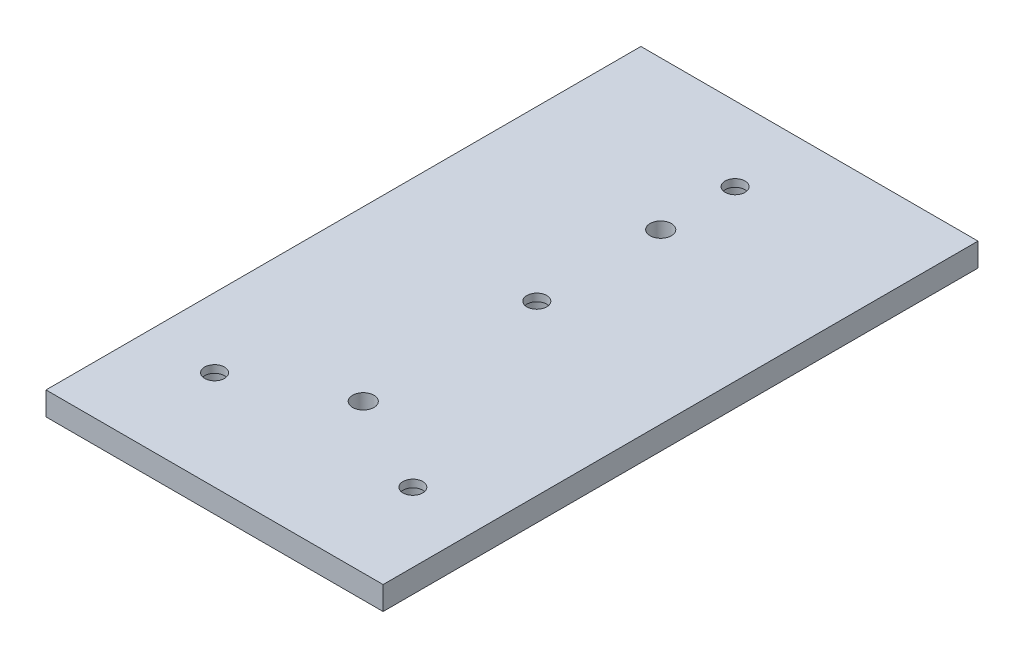
ISO-10303-21;
HEADER;
FILE_DESCRIPTION(('STEP AP214'),'2;1');
FILE_NAME('part.step','',(''),(''),'','','');
FILE_SCHEMA(('AUTOMOTIVE_DESIGN { 1 0 10303 214 1 1 1 1 }'));
ENDSEC;
DATA;
#1=APPLICATION_CONTEXT('core data for automotive mechanical design processes');
#2=APPLICATION_PROTOCOL_DEFINITION('international standard','automotive_design',2000,#1);
#3=PRODUCT_CONTEXT('',#1,'mechanical');
#4=PRODUCT('Part','Part','',(#3));
#5=PRODUCT_RELATED_PRODUCT_CATEGORY('part','',(#4));
#6=PRODUCT_DEFINITION_FORMATION('','',#4);
#7=PRODUCT_DEFINITION_CONTEXT('part definition',#1,'design');
#8=PRODUCT_DEFINITION('design','',#6,#7);
#9=PRODUCT_DEFINITION_SHAPE('','',#8);
#10=(LENGTH_UNIT() NAMED_UNIT(*) SI_UNIT(.MILLI.,.METRE.));
#11=(NAMED_UNIT(*) PLANE_ANGLE_UNIT() SI_UNIT($,.RADIAN.));
#12=(NAMED_UNIT(*) SI_UNIT($,.STERADIAN.) SOLID_ANGLE_UNIT());
#13=UNCERTAINTY_MEASURE_WITH_UNIT(LENGTH_MEASURE(1.E-05),#10,'distance_accuracy_value','');
#14=(GEOMETRIC_REPRESENTATION_CONTEXT(3) GLOBAL_UNCERTAINTY_ASSIGNED_CONTEXT((#13)) GLOBAL_UNIT_ASSIGNED_CONTEXT((#10,
#11,#12)) REPRESENTATION_CONTEXT('',''));
#15=CARTESIAN_POINT('',(0.,0.,0.));
#16=DIRECTION('',(0.,0.,1.));
#17=DIRECTION('',(1.,0.,0.));
#18=AXIS2_PLACEMENT_3D('',#15,#16,#17);
#19=CARTESIAN_POINT('',(45.72,0.,-133.35));
#20=DIRECTION('',(0.,1.,0.));
#21=DIRECTION('',(0.,0.,1.));
#22=AXIS2_PLACEMENT_3D('',#19,#20,#21);
#23=CYLINDRICAL_SURFACE('',#22,2.54000000000002);
#24=CARTESIAN_POINT('',(45.72,5.9944,-133.35));
#25=DIRECTION('',(0.,-1.,0.));
#26=DIRECTION('',(0.,0.,-1.));
#27=AXIS2_PLACEMENT_3D('',#24,#25,#26);
#28=CIRCLE('',#27,2.54000000000002);
#29=CARTESIAN_POINT('',(45.72,5.9944,-135.89));
#30=VERTEX_POINT('',#29);
#31=EDGE_CURVE('E114',#30,#30,#28,.T.);
#32=ORIENTED_EDGE('',*,*,#31,.F.);
#33=EDGE_LOOP('',(#32));
#34=FACE_BOUND('',#33,.T.);
#35=CARTESIAN_POINT('',(45.72,4.064,-133.35));
#36=DIRECTION('',(0.,-1.,0.));
#37=DIRECTION('',(0.,0.,-1.));
#38=AXIS2_PLACEMENT_3D('',#35,#36,#37);
#39=CIRCLE('',#38,2.54000000000002);
#40=CARTESIAN_POINT('',(45.72,4.064,-135.89));
#41=VERTEX_POINT('',#40);
#42=EDGE_CURVE('E41',#41,#41,#39,.F.);
#43=ORIENTED_EDGE('',*,*,#42,.F.);
#44=EDGE_LOOP('',(#43));
#45=FACE_BOUND('',#44,.T.);
#46=ADVANCED_FACE('F37',(#34,#45),#23,.F.);
#47=CARTESIAN_POINT('',(45.72,0.,-82.55));
#48=DIRECTION('',(0.,1.,0.));
#49=DIRECTION('',(0.,0.,1.));
#50=AXIS2_PLACEMENT_3D('',#47,#48,#49);
#51=CYLINDRICAL_SURFACE('',#50,2.54);
#52=CARTESIAN_POINT('',(45.72,5.9944,-82.55));
#53=DIRECTION('',(0.,-1.,0.));
#54=DIRECTION('',(0.,0.,-1.));
#55=AXIS2_PLACEMENT_3D('',#52,#53,#54);
#56=CIRCLE('',#55,2.54);
#57=CARTESIAN_POINT('',(45.72,5.9944,-85.09));
#58=VERTEX_POINT('',#57);
#59=EDGE_CURVE('E118',#58,#58,#56,.T.);
#60=ORIENTED_EDGE('',*,*,#59,.F.);
#61=EDGE_LOOP('',(#60));
#62=FACE_BOUND('',#61,.T.);
#63=CARTESIAN_POINT('',(45.72,4.064,-82.55));
#64=DIRECTION('',(0.,-1.,0.));
#65=DIRECTION('',(0.,0.,-1.));
#66=AXIS2_PLACEMENT_3D('',#63,#64,#65);
#67=CIRCLE('',#66,2.54);
#68=CARTESIAN_POINT('',(45.72,4.064,-85.09));
#69=VERTEX_POINT('',#68);
#70=EDGE_CURVE('E109',#69,#69,#67,.F.);
#71=ORIENTED_EDGE('',*,*,#70,.F.);
#72=EDGE_LOOP('',(#71));
#73=FACE_BOUND('',#72,.T.);
#74=ADVANCED_FACE('F169',(#62,#73),#51,.F.);
#75=CARTESIAN_POINT('',(71.12,0.,-25.4));
#76=DIRECTION('',(0.,1.,0.));
#77=DIRECTION('',(0.,0.,1.));
#78=AXIS2_PLACEMENT_3D('',#75,#76,#77);
#79=CYLINDRICAL_SURFACE('',#78,2.54);
#80=CARTESIAN_POINT('',(71.12,5.9944,-25.4));
#81=DIRECTION('',(0.,-1.,0.));
#82=DIRECTION('',(0.,0.,-1.));
#83=AXIS2_PLACEMENT_3D('',#80,#81,#82);
#84=CIRCLE('',#83,2.54);
#85=CARTESIAN_POINT('',(71.12,5.9944,-27.94));
#86=VERTEX_POINT('',#85);
#87=EDGE_CURVE('E123',#86,#86,#84,.T.);
#88=ORIENTED_EDGE('',*,*,#87,.F.);
#89=EDGE_LOOP('',(#88));
#90=FACE_BOUND('',#89,.T.);
#91=CARTESIAN_POINT('',(71.12,4.064,-25.4));
#92=DIRECTION('',(0.,-1.,0.));
#93=DIRECTION('',(0.,0.,-1.));
#94=AXIS2_PLACEMENT_3D('',#91,#92,#93);
#95=CIRCLE('',#94,2.54);
#96=CARTESIAN_POINT('',(71.12,4.064,-27.94));
#97=VERTEX_POINT('',#96);
#98=EDGE_CURVE('E106',#97,#97,#95,.F.);
#99=ORIENTED_EDGE('',*,*,#98,.F.);
#100=EDGE_LOOP('',(#99));
#101=FACE_BOUND('',#100,.T.);
#102=ADVANCED_FACE('F175',(#90,#101),#79,.F.);
#103=CARTESIAN_POINT('',(20.32,0.,-25.4));
#104=DIRECTION('',(0.,1.,0.));
#105=DIRECTION('',(0.,0.,1.));
#106=AXIS2_PLACEMENT_3D('',#103,#104,#105);
#107=CYLINDRICAL_SURFACE('',#106,2.54);
#108=CARTESIAN_POINT('',(20.32,5.9944,-25.4));
#109=DIRECTION('',(0.,-1.,0.));
#110=DIRECTION('',(0.,0.,-1.));
#111=AXIS2_PLACEMENT_3D('',#108,#109,#110);
#112=CIRCLE('',#111,2.54);
#113=CARTESIAN_POINT('',(20.32,5.9944,-27.94));
#114=VERTEX_POINT('',#113);
#115=EDGE_CURVE('E131',#114,#114,#112,.T.);
#116=ORIENTED_EDGE('',*,*,#115,.F.);
#117=EDGE_LOOP('',(#116));
#118=FACE_BOUND('',#117,.T.);
#119=CARTESIAN_POINT('',(20.32,4.064,-25.4));
#120=DIRECTION('',(0.,-1.,0.));
#121=DIRECTION('',(0.,0.,-1.));
#122=AXIS2_PLACEMENT_3D('',#119,#120,#121);
#123=CIRCLE('',#122,2.54);
#124=CARTESIAN_POINT('',(20.32,4.064,-27.94));
#125=VERTEX_POINT('',#124);
#126=EDGE_CURVE('E103',#125,#125,#123,.F.);
#127=ORIENTED_EDGE('',*,*,#126,.F.);
#128=EDGE_LOOP('',(#127));
#129=FACE_BOUND('',#128,.T.);
#130=ADVANCED_FACE('F324',(#118,#129),#107,.F.);
#131=CARTESIAN_POINT('',(0.,5.9944,0.));
#132=DIRECTION('',(0.,0.,-1.));
#133=DIRECTION('',(-1.,0.,0.));
#134=AXIS2_PLACEMENT_3D('',#131,#132,#133);
#135=PLANE('',#134);
#136=DIRECTION('',(1.,0.,0.));
#137=VECTOR('',#136,1.);
#138=CARTESIAN_POINT('',(0.,5.9944,0.));
#139=LINE('',#138,#137);
#140=CARTESIAN_POINT('',(2.54000000000002,5.9944,0.));
#141=VERTEX_POINT('',#140);
#142=CARTESIAN_POINT('',(88.9,5.9944,0.));
#143=VERTEX_POINT('',#142);
#144=EDGE_CURVE('E63',#141,#143,#139,.T.);
#145=ORIENTED_EDGE('',*,*,#144,.F.);
#146=DIRECTION('',(0.,1.,0.));
#147=VECTOR('',#146,1.);
#148=CARTESIAN_POINT('',(2.54000000000002,0.,0.));
#149=LINE('',#148,#147);
#150=CARTESIAN_POINT('',(2.54000000000002,0.,0.));
#151=VERTEX_POINT('',#150);
#152=EDGE_CURVE('E81',#151,#141,#149,.T.);
#153=ORIENTED_EDGE('',*,*,#152,.F.);
#154=DIRECTION('',(1.,0.,0.));
#155=VECTOR('',#154,1.);
#156=CARTESIAN_POINT('',(0.,0.,0.));
#157=LINE('',#156,#155);
#158=CARTESIAN_POINT('',(88.9,0.,0.));
#159=VERTEX_POINT('',#158);
#160=EDGE_CURVE('E77',#151,#159,#157,.T.);
#161=ORIENTED_EDGE('',*,*,#160,.T.);
#162=DIRECTION('',(0.,-1.,0.));
#163=VECTOR('',#162,1.);
#164=CARTESIAN_POINT('',(88.9,5.9944,0.));
#165=LINE('',#164,#163);
#166=EDGE_CURVE('E11',#143,#159,#165,.T.);
#167=ORIENTED_EDGE('',*,*,#166,.F.);
#168=EDGE_LOOP('',(#145,#153,#161,#167));
#169=FACE_BOUND('',#168,.T.);
#170=ADVANCED_FACE('F78',(#169),#135,.F.);
#171=CARTESIAN_POINT('',(88.9,5.9944,-152.4));
#172=DIRECTION('',(1.,0.,0.));
#173=DIRECTION('',(0.,0.,-1.));
#174=AXIS2_PLACEMENT_3D('',#171,#172,#173);
#175=PLANE('',#174);
#176=DIRECTION('',(0.,0.,1.));
#177=VECTOR('',#176,1.);
#178=CARTESIAN_POINT('',(88.9,0.,-152.4));
#179=LINE('',#178,#177);
#180=CARTESIAN_POINT('',(88.9,0.,-152.4));
#181=VERTEX_POINT('',#180);
#182=EDGE_CURVE('E85',#181,#159,#179,.T.);
#183=ORIENTED_EDGE('',*,*,#182,.F.);
#184=DIRECTION('',(0.,-1.,0.));
#185=VECTOR('',#184,1.);
#186=CARTESIAN_POINT('',(88.9,5.9944,-152.4));
#187=LINE('',#186,#185);
#188=CARTESIAN_POINT('',(88.9,5.9944,-152.4));
#189=VERTEX_POINT('',#188);
#190=EDGE_CURVE('E46',#189,#181,#187,.T.);
#191=ORIENTED_EDGE('',*,*,#190,.F.);
#192=DIRECTION('',(0.,0.,1.));
#193=VECTOR('',#192,1.);
#194=CARTESIAN_POINT('',(88.9,5.9944,-152.4));
#195=LINE('',#194,#193);
#196=EDGE_CURVE('E91',#189,#143,#195,.T.);
#197=ORIENTED_EDGE('',*,*,#196,.T.);
#198=ORIENTED_EDGE('',*,*,#166,.T.);
#199=EDGE_LOOP('',(#183,#191,#197,#198));
#200=FACE_BOUND('',#199,.T.);
#201=ADVANCED_FACE('F89',(#200),#175,.T.);
#202=CARTESIAN_POINT('',(0.,5.9944,-152.4));
#203=DIRECTION('',(0.,0.,-1.));
#204=DIRECTION('',(-1.,0.,0.));
#205=AXIS2_PLACEMENT_3D('',#202,#203,#204);
#206=PLANE('',#205);
#207=DIRECTION('',(0.,1.,0.));
#208=VECTOR('',#207,1.);
#209=CARTESIAN_POINT('',(2.54,0.,-152.4));
#210=LINE('',#209,#208);
#211=CARTESIAN_POINT('',(2.54000000000001,0.,-152.4));
#212=VERTEX_POINT('',#211);
#213=CARTESIAN_POINT('',(2.54,5.9944,-152.4));
#214=VERTEX_POINT('',#213);
#215=EDGE_CURVE('E54',#212,#214,#210,.T.);
#216=ORIENTED_EDGE('',*,*,#215,.T.);
#217=DIRECTION('',(1.,0.,0.));
#218=VECTOR('',#217,1.);
#219=CARTESIAN_POINT('',(0.,5.9944,-152.4));
#220=LINE('',#219,#218);
#221=EDGE_CURVE('E84',#214,#189,#220,.T.);
#222=ORIENTED_EDGE('',*,*,#221,.T.);
#223=ORIENTED_EDGE('',*,*,#190,.T.);
#224=DIRECTION('',(1.,0.,0.));
#225=VECTOR('',#224,1.);
#226=CARTESIAN_POINT('',(0.,0.,-152.4));
#227=LINE('',#226,#225);
#228=EDGE_CURVE('E95',#212,#181,#227,.T.);
#229=ORIENTED_EDGE('',*,*,#228,.F.);
#230=EDGE_LOOP('',(#216,#222,#223,#229));
#231=FACE_BOUND('',#230,.T.);
#232=ADVANCED_FACE('F39',(#231),#206,.T.);
#233=CARTESIAN_POINT('',(0.,5.9944,0.));
#234=DIRECTION('',(0.,-1.,0.));
#235=DIRECTION('',(0.,0.,-1.));
#236=AXIS2_PLACEMENT_3D('',#233,#234,#235);
#237=PLANE('',#236);
#238=ORIENTED_EDGE('',*,*,#115,.T.);
#239=EDGE_LOOP('',(#238));
#240=FACE_BOUND('',#239,.T.);
#241=ORIENTED_EDGE('',*,*,#87,.T.);
#242=EDGE_LOOP('',(#241));
#243=FACE_BOUND('',#242,.T.);
#244=ORIENTED_EDGE('',*,*,#59,.T.);
#245=EDGE_LOOP('',(#244));
#246=FACE_BOUND('',#245,.T.);
#247=ORIENTED_EDGE('',*,*,#31,.T.);
#248=EDGE_LOOP('',(#247));
#249=FACE_BOUND('',#248,.T.);
#250=CARTESIAN_POINT('',(45.72,5.9944,-114.3));
#251=DIRECTION('',(0.,1.,0.));
#252=DIRECTION('',(0.,0.,1.));
#253=AXIS2_PLACEMENT_3D('',#250,#251,#252);
#254=CIRCLE('',#253,2.7305);
#255=CARTESIAN_POINT('',(45.72,5.9944,-111.5695));
#256=VERTEX_POINT('',#255);
#257=EDGE_CURVE('E143',#256,#256,#254,.T.);
#258=ORIENTED_EDGE('',*,*,#257,.F.);
#259=EDGE_LOOP('',(#258));
#260=FACE_BOUND('',#259,.T.);
#261=CARTESIAN_POINT('',(45.72,5.9944,-38.1));
#262=DIRECTION('',(0.,1.,0.));
#263=DIRECTION('',(0.,0.,1.));
#264=AXIS2_PLACEMENT_3D('',#261,#262,#263);
#265=CIRCLE('',#264,2.7305);
#266=CARTESIAN_POINT('',(45.72,5.9944,-35.3695));
#267=VERTEX_POINT('',#266);
#268=EDGE_CURVE('E146',#267,#267,#265,.T.);
#269=ORIENTED_EDGE('',*,*,#268,.F.);
#270=EDGE_LOOP('',(#269));
#271=FACE_BOUND('',#270,.T.);
#272=ORIENTED_EDGE('',*,*,#221,.F.);
#273=DIRECTION('',(0.,0.,-1.));
#274=VECTOR('',#273,1.);
#275=CARTESIAN_POINT('',(2.54,5.9944,-152.4));
#276=LINE('',#275,#274);
#277=EDGE_CURVE('E134',#141,#214,#276,.T.);
#278=ORIENTED_EDGE('',*,*,#277,.F.);
#279=ORIENTED_EDGE('',*,*,#144,.T.);
#280=ORIENTED_EDGE('',*,*,#196,.F.);
#281=EDGE_LOOP('',(#272,#278,#279,#280));
#282=FACE_BOUND('',#281,.T.);
#283=ADVANCED_FACE('F155',(#240,#243,#246,#249,#260,#271,#282),#237,.F.);
#284=CARTESIAN_POINT('',(0.,0.,0.));
#285=DIRECTION('',(0.,-1.,0.));
#286=DIRECTION('',(0.,0.,-1.));
#287=AXIS2_PLACEMENT_3D('',#284,#285,#286);
#288=PLANE('',#287);
#289=CARTESIAN_POINT('',(20.32,0.,-25.4));
#290=DIRECTION('',(0.,-1.,0.));
#291=DIRECTION('',(0.,0.,-1.));
#292=AXIS2_PLACEMENT_3D('',#289,#290,#291);
#293=CIRCLE('',#292,3.683);
#294=CARTESIAN_POINT('',(20.32,0.,-29.083));
#295=VERTEX_POINT('',#294);
#296=EDGE_CURVE('E425',#295,#295,#293,.T.);
#297=ORIENTED_EDGE('',*,*,#296,.F.);
#298=EDGE_LOOP('',(#297));
#299=FACE_BOUND('',#298,.T.);
#300=CARTESIAN_POINT('',(71.12,0.,-25.4));
#301=DIRECTION('',(0.,-1.,0.));
#302=DIRECTION('',(0.,0.,-1.));
#303=AXIS2_PLACEMENT_3D('',#300,#301,#302);
#304=CIRCLE('',#303,3.683);
#305=CARTESIAN_POINT('',(71.12,0.,-29.083));
#306=VERTEX_POINT('',#305);
#307=EDGE_CURVE('E422',#306,#306,#304,.T.);
#308=ORIENTED_EDGE('',*,*,#307,.F.);
#309=EDGE_LOOP('',(#308));
#310=FACE_BOUND('',#309,.T.);
#311=CARTESIAN_POINT('',(45.72,0.,-82.55));
#312=DIRECTION('',(0.,-1.,0.));
#313=DIRECTION('',(0.,0.,-1.));
#314=AXIS2_PLACEMENT_3D('',#311,#312,#313);
#315=CIRCLE('',#314,3.683);
#316=CARTESIAN_POINT('',(45.72,0.,-86.233));
#317=VERTEX_POINT('',#316);
#318=EDGE_CURVE('E414',#317,#317,#315,.T.);
#319=ORIENTED_EDGE('',*,*,#318,.F.);
#320=EDGE_LOOP('',(#319));
#321=FACE_BOUND('',#320,.T.);
#322=CARTESIAN_POINT('',(45.72,0.,-133.35));
#323=DIRECTION('',(0.,-1.,0.));
#324=DIRECTION('',(0.,0.,-1.));
#325=AXIS2_PLACEMENT_3D('',#322,#323,#324);
#326=CIRCLE('',#325,3.683);
#327=CARTESIAN_POINT('',(45.72,0.,-137.033));
#328=VERTEX_POINT('',#327);
#329=EDGE_CURVE('E410',#328,#328,#326,.T.);
#330=ORIENTED_EDGE('',*,*,#329,.F.);
#331=EDGE_LOOP('',(#330));
#332=FACE_BOUND('',#331,.T.);
#333=DIRECTION('',(0.,0.,-1.));
#334=VECTOR('',#333,1.);
#335=CARTESIAN_POINT('',(2.54,0.,-152.4));
#336=LINE('',#335,#334);
#337=EDGE_CURVE('E135',#151,#212,#336,.T.);
#338=ORIENTED_EDGE('',*,*,#337,.T.);
#339=ORIENTED_EDGE('',*,*,#228,.T.);
#340=ORIENTED_EDGE('',*,*,#182,.T.);
#341=ORIENTED_EDGE('',*,*,#160,.F.);
#342=EDGE_LOOP('',(#338,#339,#340,#341));
#343=FACE_BOUND('',#342,.T.);
#344=CARTESIAN_POINT('',(45.72,0.,-114.3));
#345=DIRECTION('',(0.,1.,0.));
#346=DIRECTION('',(0.,0.,1.));
#347=AXIS2_PLACEMENT_3D('',#344,#345,#346);
#348=CIRCLE('',#347,2.7305);
#349=CARTESIAN_POINT('',(45.72,0.,-111.5695));
#350=VERTEX_POINT('',#349);
#351=EDGE_CURVE('E98',#350,#350,#348,.T.);
#352=ORIENTED_EDGE('',*,*,#351,.T.);
#353=EDGE_LOOP('',(#352));
#354=FACE_BOUND('',#353,.T.);
#355=CARTESIAN_POINT('',(45.72,0.,-38.1));
#356=DIRECTION('',(0.,1.,0.));
#357=DIRECTION('',(0.,0.,1.));
#358=AXIS2_PLACEMENT_3D('',#355,#356,#357);
#359=CIRCLE('',#358,2.7305);
#360=CARTESIAN_POINT('',(45.72,0.,-35.3695));
#361=VERTEX_POINT('',#360);
#362=EDGE_CURVE('E139',#361,#361,#359,.T.);
#363=ORIENTED_EDGE('',*,*,#362,.T.);
#364=EDGE_LOOP('',(#363));
#365=FACE_BOUND('',#364,.T.);
#366=ADVANCED_FACE('F92',(#299,#310,#321,#332,#343,#354,#365),#288,.T.);
#367=CARTESIAN_POINT('',(45.72,0.,-38.1));
#368=DIRECTION('',(0.,1.,0.));
#369=DIRECTION('',(0.,0.,1.));
#370=AXIS2_PLACEMENT_3D('',#367,#368,#369);
#371=CYLINDRICAL_SURFACE('',#370,2.7305);
#372=ORIENTED_EDGE('',*,*,#362,.F.);
#373=EDGE_LOOP('',(#372));
#374=FACE_BOUND('',#373,.T.);
#375=ORIENTED_EDGE('',*,*,#268,.T.);
#376=EDGE_LOOP('',(#375));
#377=FACE_BOUND('',#376,.T.);
#378=ADVANCED_FACE('F163',(#374,#377),#371,.F.);
#379=CARTESIAN_POINT('',(45.72,0.,-114.3));
#380=DIRECTION('',(0.,1.,0.));
#381=DIRECTION('',(0.,0.,1.));
#382=AXIS2_PLACEMENT_3D('',#379,#380,#381);
#383=CYLINDRICAL_SURFACE('',#382,2.7305);
#384=ORIENTED_EDGE('',*,*,#351,.F.);
#385=EDGE_LOOP('',(#384));
#386=FACE_BOUND('',#385,.T.);
#387=ORIENTED_EDGE('',*,*,#257,.T.);
#388=EDGE_LOOP('',(#387));
#389=FACE_BOUND('',#388,.T.);
#390=ADVANCED_FACE('F185',(#386,#389),#383,.F.);
#391=CARTESIAN_POINT('',(2.54,0.,-152.4));
#392=DIRECTION('',(1.,0.,0.));
#393=DIRECTION('',(0.,0.,-1.));
#394=AXIS2_PLACEMENT_3D('',#391,#392,#393);
#395=PLANE('',#394);
#396=ORIENTED_EDGE('',*,*,#277,.T.);
#397=ORIENTED_EDGE('',*,*,#215,.F.);
#398=ORIENTED_EDGE('',*,*,#337,.F.);
#399=ORIENTED_EDGE('',*,*,#152,.T.);
#400=EDGE_LOOP('',(#396,#397,#398,#399));
#401=FACE_BOUND('',#400,.T.);
#402=ADVANCED_FACE('F181',(#401),#395,.F.);
#403=CARTESIAN_POINT('',(20.32,4.064,-25.4));
#404=DIRECTION('',(0.,-1.,0.));
#405=DIRECTION('',(0.,0.,-1.));
#406=AXIS2_PLACEMENT_3D('',#403,#404,#405);
#407=PLANE('',#406);
#408=CARTESIAN_POINT('',(20.32,4.064,-25.4));
#409=DIRECTION('',(0.,-1.,0.));
#410=DIRECTION('',(0.,0.,-1.));
#411=AXIS2_PLACEMENT_3D('',#408,#409,#410);
#412=CIRCLE('',#411,3.683);
#413=CARTESIAN_POINT('',(20.32,4.064,-29.083));
#414=VERTEX_POINT('',#413);
#415=EDGE_CURVE('E107',#414,#414,#412,.T.);
#416=ORIENTED_EDGE('',*,*,#415,.T.);
#417=EDGE_LOOP('',(#416));
#418=FACE_BOUND('',#417,.T.);
#419=ORIENTED_EDGE('',*,*,#126,.T.);
#420=EDGE_LOOP('',(#419));
#421=FACE_BOUND('',#420,.T.);
#422=ADVANCED_FACE('F184',(#418,#421),#407,.T.);
#423=CARTESIAN_POINT('',(20.32,4.064,-25.4));
#424=DIRECTION('',(0.,-1.,0.));
#425=DIRECTION('',(0.,0.,-1.));
#426=AXIS2_PLACEMENT_3D('',#423,#424,#425);
#427=CYLINDRICAL_SURFACE('',#426,3.683);
#428=ORIENTED_EDGE('',*,*,#415,.F.);
#429=EDGE_LOOP('',(#428));
#430=FACE_BOUND('',#429,.T.);
#431=ORIENTED_EDGE('',*,*,#296,.T.);
#432=EDGE_LOOP('',(#431));
#433=FACE_BOUND('',#432,.T.);
#434=ADVANCED_FACE('F216',(#430,#433),#427,.F.);
#435=CARTESIAN_POINT('',(71.12,4.064,-25.4));
#436=DIRECTION('',(0.,-1.,0.));
#437=DIRECTION('',(0.,0.,-1.));
#438=AXIS2_PLACEMENT_3D('',#435,#436,#437);
#439=PLANE('',#438);
#440=CARTESIAN_POINT('',(71.12,4.064,-25.4));
#441=DIRECTION('',(0.,-1.,0.));
#442=DIRECTION('',(0.,0.,-1.));
#443=AXIS2_PLACEMENT_3D('',#440,#441,#442);
#444=CIRCLE('',#443,3.683);
#445=CARTESIAN_POINT('',(71.12,4.064,-29.083));
#446=VERTEX_POINT('',#445);
#447=EDGE_CURVE('E419',#446,#446,#444,.T.);
#448=ORIENTED_EDGE('',*,*,#447,.T.);
#449=EDGE_LOOP('',(#448));
#450=FACE_BOUND('',#449,.T.);
#451=ORIENTED_EDGE('',*,*,#98,.T.);
#452=EDGE_LOOP('',(#451));
#453=FACE_BOUND('',#452,.T.);
#454=ADVANCED_FACE('F224',(#450,#453),#439,.T.);
#455=CARTESIAN_POINT('',(71.12,4.064,-25.4));
#456=DIRECTION('',(0.,-1.,0.));
#457=DIRECTION('',(0.,0.,-1.));
#458=AXIS2_PLACEMENT_3D('',#455,#456,#457);
#459=CYLINDRICAL_SURFACE('',#458,3.683);
#460=ORIENTED_EDGE('',*,*,#447,.F.);
#461=EDGE_LOOP('',(#460));
#462=FACE_BOUND('',#461,.T.);
#463=ORIENTED_EDGE('',*,*,#307,.T.);
#464=EDGE_LOOP('',(#463));
#465=FACE_BOUND('',#464,.T.);
#466=ADVANCED_FACE('F232',(#462,#465),#459,.F.);
#467=CARTESIAN_POINT('',(45.72,4.064,-82.55));
#468=DIRECTION('',(0.,-1.,0.));
#469=DIRECTION('',(0.,0.,-1.));
#470=AXIS2_PLACEMENT_3D('',#467,#468,#469);
#471=PLANE('',#470);
#472=CARTESIAN_POINT('',(45.72,4.064,-82.55));
#473=DIRECTION('',(0.,-1.,0.));
#474=DIRECTION('',(0.,0.,-1.));
#475=AXIS2_PLACEMENT_3D('',#472,#473,#474);
#476=CIRCLE('',#475,3.683);
#477=CARTESIAN_POINT('',(45.72,4.064,-86.233));
#478=VERTEX_POINT('',#477);
#479=EDGE_CURVE('E412',#478,#478,#476,.T.);
#480=ORIENTED_EDGE('',*,*,#479,.T.);
#481=EDGE_LOOP('',(#480));
#482=FACE_BOUND('',#481,.T.);
#483=ORIENTED_EDGE('',*,*,#70,.T.);
#484=EDGE_LOOP('',(#483));
#485=FACE_BOUND('',#484,.T.);
#486=ADVANCED_FACE('F240',(#482,#485),#471,.T.);
#487=CARTESIAN_POINT('',(45.72,4.064,-82.55));
#488=DIRECTION('',(0.,-1.,0.));
#489=DIRECTION('',(0.,0.,-1.));
#490=AXIS2_PLACEMENT_3D('',#487,#488,#489);
#491=CYLINDRICAL_SURFACE('',#490,3.683);
#492=ORIENTED_EDGE('',*,*,#479,.F.);
#493=EDGE_LOOP('',(#492));
#494=FACE_BOUND('',#493,.T.);
#495=ORIENTED_EDGE('',*,*,#318,.T.);
#496=EDGE_LOOP('',(#495));
#497=FACE_BOUND('',#496,.T.);
#498=ADVANCED_FACE('F248',(#494,#497),#491,.F.);
#499=CARTESIAN_POINT('',(45.72,4.064,-133.35));
#500=DIRECTION('',(0.,-1.,0.));
#501=DIRECTION('',(0.,0.,-1.));
#502=AXIS2_PLACEMENT_3D('',#499,#500,#501);
#503=PLANE('',#502);
#504=CARTESIAN_POINT('',(45.72,4.064,-133.35));
#505=DIRECTION('',(0.,-1.,0.));
#506=DIRECTION('',(0.,0.,-1.));
#507=AXIS2_PLACEMENT_3D('',#504,#505,#506);
#508=CIRCLE('',#507,3.683);
#509=CARTESIAN_POINT('',(45.72,4.064,-137.033));
#510=VERTEX_POINT('',#509);
#511=EDGE_CURVE('E126',#510,#510,#508,.T.);
#512=ORIENTED_EDGE('',*,*,#511,.T.);
#513=EDGE_LOOP('',(#512));
#514=FACE_BOUND('',#513,.T.);
#515=ORIENTED_EDGE('',*,*,#42,.T.);
#516=EDGE_LOOP('',(#515));
#517=FACE_BOUND('',#516,.T.);
#518=ADVANCED_FACE('F256',(#514,#517),#503,.T.);
#519=CARTESIAN_POINT('',(45.72,4.064,-133.35));
#520=DIRECTION('',(0.,-1.,0.));
#521=DIRECTION('',(0.,0.,-1.));
#522=AXIS2_PLACEMENT_3D('',#519,#520,#521);
#523=CYLINDRICAL_SURFACE('',#522,3.683);
#524=ORIENTED_EDGE('',*,*,#511,.F.);
#525=EDGE_LOOP('',(#524));
#526=FACE_BOUND('',#525,.T.);
#527=ORIENTED_EDGE('',*,*,#329,.T.);
#528=EDGE_LOOP('',(#527));
#529=FACE_BOUND('',#528,.T.);
#530=ADVANCED_FACE('F264',(#526,#529),#523,.F.);
#531=CLOSED_SHELL('',(#46,#74,#102,#130,#170,#201,#232,#283,#366,#378,#390,#402,#422,#434,#454,
#466,#486,#498,#518,#530));
#532=MANIFOLD_SOLID_BREP('B2',#531);
#533=ADVANCED_BREP_SHAPE_REPRESENTATION('',(#18,#532),#14);
#534=SHAPE_DEFINITION_REPRESENTATION(#9,#533);
ENDSEC;
END-ISO-10303-21;
